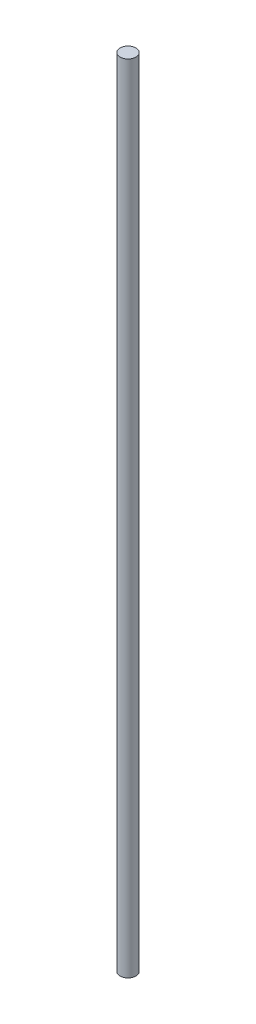
ISO-10303-21;
HEADER;
FILE_DESCRIPTION(('STEP AP214'),'2;1');
FILE_NAME('part.step','',(''),(''),'','','');
FILE_SCHEMA(('AUTOMOTIVE_DESIGN { 1 0 10303 214 1 1 1 1 }'));
ENDSEC;
DATA;
#1=APPLICATION_CONTEXT('core data for automotive mechanical design processes');
#2=APPLICATION_PROTOCOL_DEFINITION('international standard','automotive_design',2000,#1);
#3=PRODUCT_CONTEXT('',#1,'mechanical');
#4=PRODUCT('Part','Part','',(#3));
#5=PRODUCT_RELATED_PRODUCT_CATEGORY('part','',(#4));
#6=PRODUCT_DEFINITION_FORMATION('','',#4);
#7=PRODUCT_DEFINITION_CONTEXT('part definition',#1,'design');
#8=PRODUCT_DEFINITION('design','',#6,#7);
#9=PRODUCT_DEFINITION_SHAPE('','',#8);
#10=(LENGTH_UNIT() NAMED_UNIT(*) SI_UNIT(.MILLI.,.METRE.));
#11=(NAMED_UNIT(*) PLANE_ANGLE_UNIT() SI_UNIT($,.RADIAN.));
#12=(NAMED_UNIT(*) SI_UNIT($,.STERADIAN.) SOLID_ANGLE_UNIT());
#13=UNCERTAINTY_MEASURE_WITH_UNIT(LENGTH_MEASURE(1.E-05),#10,'distance_accuracy_value','');
#14=(GEOMETRIC_REPRESENTATION_CONTEXT(3) GLOBAL_UNCERTAINTY_ASSIGNED_CONTEXT((#13)) GLOBAL_UNIT_ASSIGNED_CONTEXT((#10,
#11,#12)) REPRESENTATION_CONTEXT('',''));
#15=CARTESIAN_POINT('',(0.,0.,0.));
#16=DIRECTION('',(0.,0.,1.));
#17=DIRECTION('',(1.,0.,0.));
#18=AXIS2_PLACEMENT_3D('',#15,#16,#17);
#19=CARTESIAN_POINT('',(0.,400.,0.));
#20=DIRECTION('',(0.,-1.,0.));
#21=DIRECTION('',(0.,0.,-1.));
#22=AXIS2_PLACEMENT_3D('',#19,#20,#21);
#23=CYLINDRICAL_SURFACE('',#22,4.);
#24=CARTESIAN_POINT('',(0.,400.,0.));
#25=DIRECTION('',(0.,1.,0.));
#26=DIRECTION('',(0.,0.,1.));
#27=AXIS2_PLACEMENT_3D('',#24,#25,#26);
#28=CIRCLE('',#27,4.);
#29=CARTESIAN_POINT('',(0.,400.,4.));
#30=VERTEX_POINT('',#29);
#31=EDGE_CURVE('E10',#30,#30,#28,.T.);
#32=ORIENTED_EDGE('',*,*,#31,.F.);
#33=EDGE_LOOP('',(#32));
#34=FACE_BOUND('',#33,.T.);
#35=CARTESIAN_POINT('',(0.,0.,0.));
#36=DIRECTION('',(0.,1.,0.));
#37=DIRECTION('',(0.,0.,1.));
#38=AXIS2_PLACEMENT_3D('',#35,#36,#37);
#39=CIRCLE('',#38,4.);
#40=CARTESIAN_POINT('',(0.,0.,4.));
#41=VERTEX_POINT('',#40);
#42=EDGE_CURVE('E33',#41,#41,#39,.T.);
#43=ORIENTED_EDGE('',*,*,#42,.T.);
#44=EDGE_LOOP('',(#43));
#45=FACE_BOUND('',#44,.T.);
#46=ADVANCED_FACE('F30',(#34,#45),#23,.T.);
#47=CARTESIAN_POINT('',(0.,400.,0.));
#48=DIRECTION('',(0.,1.,0.));
#49=DIRECTION('',(0.,0.,1.));
#50=AXIS2_PLACEMENT_3D('',#47,#48,#49);
#51=PLANE('',#50);
#52=ORIENTED_EDGE('',*,*,#31,.T.);
#53=EDGE_LOOP('',(#52));
#54=FACE_BOUND('',#53,.T.);
#55=ADVANCED_FACE('F45',(#54),#51,.T.);
#56=CARTESIAN_POINT('',(0.,0.,0.));
#57=DIRECTION('',(0.,1.,0.));
#58=DIRECTION('',(0.,0.,1.));
#59=AXIS2_PLACEMENT_3D('',#56,#57,#58);
#60=PLANE('',#59);
#61=ORIENTED_EDGE('',*,*,#42,.F.);
#62=EDGE_LOOP('',(#61));
#63=FACE_BOUND('',#62,.T.);
#64=ADVANCED_FACE('F43',(#63),#60,.F.);
#65=CLOSED_SHELL('',(#46,#55,#64));
#66=MANIFOLD_SOLID_BREP('B2',#65);
#67=ADVANCED_BREP_SHAPE_REPRESENTATION('',(#18,#66),#14);
#68=SHAPE_DEFINITION_REPRESENTATION(#9,#67);
ENDSEC;
END-ISO-10303-21;
